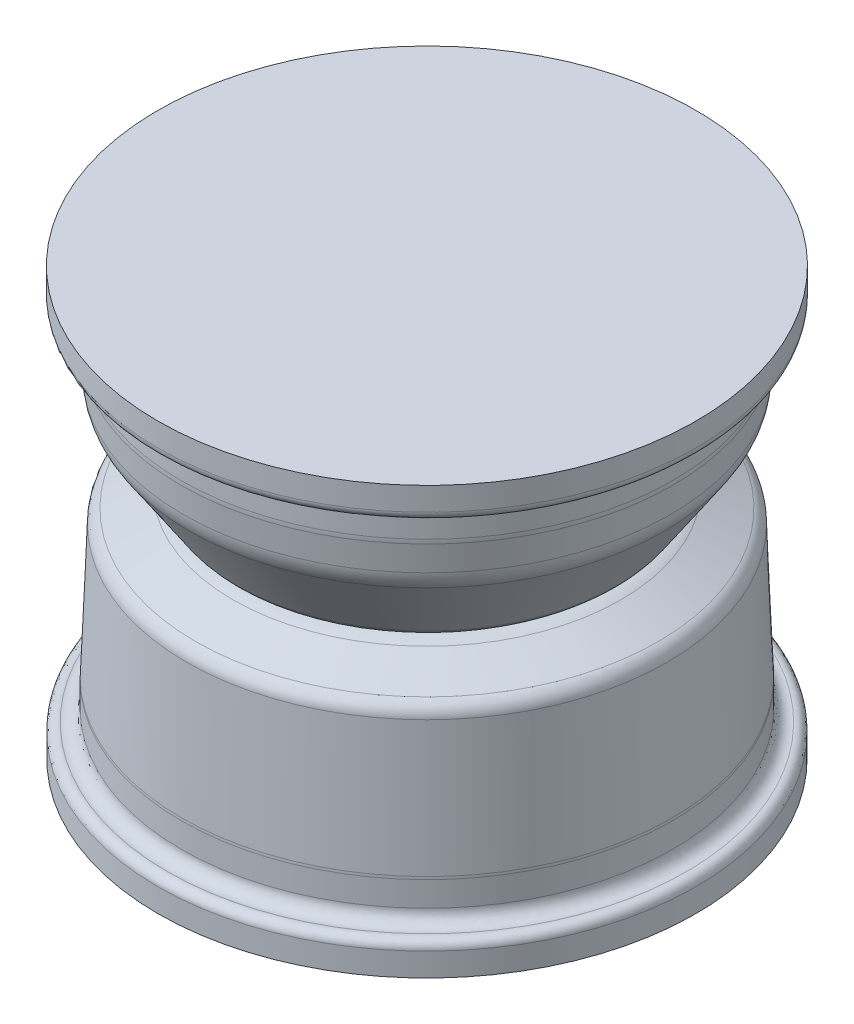
ISO-10303-21;
HEADER;
FILE_DESCRIPTION(('STEP AP214'),'2;1');
FILE_NAME('part.step','',(''),(''),'','','');
FILE_SCHEMA(('AUTOMOTIVE_DESIGN { 1 0 10303 214 1 1 1 1 }'));
ENDSEC;
DATA;
#1=APPLICATION_CONTEXT('core data for automotive mechanical design processes');
#2=APPLICATION_PROTOCOL_DEFINITION('international standard','automotive_design',2000,#1);
#3=PRODUCT_CONTEXT('',#1,'mechanical');
#4=PRODUCT('Part','Part','',(#3));
#5=PRODUCT_RELATED_PRODUCT_CATEGORY('part','',(#4));
#6=PRODUCT_DEFINITION_FORMATION('','',#4);
#7=PRODUCT_DEFINITION_CONTEXT('part definition',#1,'design');
#8=PRODUCT_DEFINITION('design','',#6,#7);
#9=PRODUCT_DEFINITION_SHAPE('','',#8);
#10=(LENGTH_UNIT() NAMED_UNIT(*) SI_UNIT(.MILLI.,.METRE.));
#11=(NAMED_UNIT(*) PLANE_ANGLE_UNIT() SI_UNIT($,.RADIAN.));
#12=(NAMED_UNIT(*) SI_UNIT($,.STERADIAN.) SOLID_ANGLE_UNIT());
#13=UNCERTAINTY_MEASURE_WITH_UNIT(LENGTH_MEASURE(1.E-05),#10,'distance_accuracy_value','');
#14=(GEOMETRIC_REPRESENTATION_CONTEXT(3) GLOBAL_UNCERTAINTY_ASSIGNED_CONTEXT((#13)) GLOBAL_UNIT_ASSIGNED_CONTEXT((#10,
#11,#12)) REPRESENTATION_CONTEXT('',''));
#15=CARTESIAN_POINT('',(0.,0.,0.));
#16=DIRECTION('',(0.,0.,1.));
#17=DIRECTION('',(1.,0.,0.));
#18=AXIS2_PLACEMENT_3D('',#15,#16,#17);
#19=CARTESIAN_POINT('',(0.,13.0472913738795,91.7987750000028));
#20=DIRECTION('',(0.,-1.,0.));
#21=DIRECTION('',(0.,0.,-1.));
#22=AXIS2_PLACEMENT_3D('',#19,#20,#21);
#23=PLANE('',#22);
#24=CARTESIAN_POINT('',(0.,13.0472913738795,0.));
#25=DIRECTION('',(0.,1.,0.));
#26=DIRECTION('',(0.,0.,1.));
#27=AXIS2_PLACEMENT_3D('',#24,#25,#26);
#28=CIRCLE('',#27,91.1860000000005);
#29=CARTESIAN_POINT('',(0.,13.0472913738795,91.1860000000005));
#30=VERTEX_POINT('',#29);
#31=EDGE_CURVE('E97',#30,#30,#28,.T.);
#32=ORIENTED_EDGE('',*,*,#31,.F.);
#33=EDGE_LOOP('',(#32));
#34=FACE_BOUND('',#33,.T.);
#35=CARTESIAN_POINT('',(0.,13.0472913738795,0.));
#36=DIRECTION('',(0.,1.,0.));
#37=DIRECTION('',(0.,0.,1.));
#38=AXIS2_PLACEMENT_3D('',#35,#36,#37);
#39=CIRCLE('',#38,91.7987750000028);
#40=CARTESIAN_POINT('',(0.,13.0472913738795,91.7987750000028));
#41=VERTEX_POINT('',#40);
#42=EDGE_CURVE('E10',#41,#41,#39,.T.);
#43=ORIENTED_EDGE('',*,*,#42,.T.);
#44=EDGE_LOOP('',(#43));
#45=FACE_BOUND('',#44,.T.);
#46=ADVANCED_FACE('F33',(#34,#45),#23,.F.);
#47=CARTESIAN_POINT('',(0.,13.0472913738795,91.7987750000028));
#48=CARTESIAN_POINT('',(0.,13.0472913738793,94.605850648923));
#49=CARTESIAN_POINT('',(0.,12.4331662406384,97.3224330848818));
#50=CARTESIAN_POINT('',(0.,11.2624547169263,99.8255002525088));
#51=(BOUNDED_CURVE() B_SPLINE_CURVE(3,(#47,#48,#49,#50),.UNSPECIFIED.,.F.,
.F.) B_SPLINE_CURVE_WITH_KNOTS((4,4),(0.,1.),
.UNSPECIFIED.) CURVE() GEOMETRIC_REPRESENTATION_ITEM() RATIONAL_B_SPLINE_CURVE((0.254333095030252,
0.254333095030252,0.258499793724843,0.266833191114025)) REPRESENTATION_ITEM(''));
#52=CARTESIAN_POINT('',(0.,55.,0.));
#53=DIRECTION('',(0.,1.,0.));
#54=AXIS1_PLACEMENT('',#52,#53);
#55=SURFACE_OF_REVOLUTION('',#51,#54);
#56=CARTESIAN_POINT('',(0.,11.2624547169263,0.));
#57=DIRECTION('',(0.,1.,0.));
#58=DIRECTION('',(0.,0.,1.));
#59=AXIS2_PLACEMENT_3D('',#56,#57,#58);
#60=CIRCLE('',#59,99.8255002525088);
#61=CARTESIAN_POINT('',(0.,11.2624547169263,99.8255002525088));
#62=VERTEX_POINT('',#61);
#63=EDGE_CURVE('E39',#62,#62,#60,.T.);
#64=ORIENTED_EDGE('',*,*,#63,.T.);
#65=EDGE_LOOP('',(#64));
#66=FACE_BOUND('',#65,.T.);
#67=ORIENTED_EDGE('',*,*,#42,.F.);
#68=EDGE_LOOP('',(#67));
#69=FACE_BOUND('',#68,.T.);
#70=ADVANCED_FACE('F111',(#66,#69),#55,.F.);
#71=CARTESIAN_POINT('',(0.,2.26769556187344,0.));
#72=DIRECTION('',(0.,-1.,0.));
#73=DIRECTION('',(0.,0.,-1.));
#74=AXIS2_PLACEMENT_3D('',#71,#72,#73);
#75=CONICAL_SURFACE('',#74,119.056955539065,1.13331210913777);
#76=ORIENTED_EDGE('',*,*,#63,.F.);
#77=EDGE_LOOP('',(#76));
#78=FACE_BOUND('',#77,.T.);
#79=CARTESIAN_POINT('',(0.,2.26769556187344,0.));
#80=DIRECTION('',(0.,1.,0.));
#81=DIRECTION('',(0.,0.,1.));
#82=AXIS2_PLACEMENT_3D('',#79,#80,#81);
#83=CIRCLE('',#82,119.056955539065);
#84=CARTESIAN_POINT('',(0.,2.26769556187344,119.056955539065));
#85=VERTEX_POINT('',#84);
#86=EDGE_CURVE('E43',#85,#85,#83,.T.);
#87=ORIENTED_EDGE('',*,*,#86,.T.);
#88=EDGE_LOOP('',(#87));
#89=FACE_BOUND('',#88,.T.);
#90=ADVANCED_FACE('F114',(#78,#89),#75,.T.);
#91=CARTESIAN_POINT('',(0.,-4.97886739746323,0.));
#92=DIRECTION('',(0.,1.,0.));
#93=DIRECTION('',(0.,0.,1.));
#94=AXIS2_PLACEMENT_3D('',#91,#92,#93);
#95=TOROIDAL_SURFACE('',#94,115.667659848753,8.);
#96=ORIENTED_EDGE('',*,*,#86,.F.);
#97=EDGE_LOOP('',(#96));
#98=FACE_BOUND('',#97,.T.);
#99=CARTESIAN_POINT('',(0.,-4.67176492476311,0.));
#100=DIRECTION('',(0.,1.,0.));
#101=DIRECTION('',(0.,0.,1.));
#102=AXIS2_PLACEMENT_3D('',#99,#100,#101);
#103=CIRCLE('',#102,123.661763180038);
#104=CARTESIAN_POINT('',(0.,-4.67176492476311,123.661763180038));
#105=VERTEX_POINT('',#104);
#106=EDGE_CURVE('E47',#105,#105,#103,.T.);
#107=ORIENTED_EDGE('',*,*,#106,.T.);
#108=EDGE_LOOP('',(#107));
#109=FACE_BOUND('',#108,.T.);
#110=ADVANCED_FACE('F117',(#98,#109),#95,.T.);
#111=CARTESIAN_POINT('',(0.,-72.7393119640824,0.));
#112=DIRECTION('',(0.,-1.,0.));
#113=DIRECTION('',(0.,0.,-1.));
#114=AXIS2_PLACEMENT_3D('',#111,#112,#113);
#115=CONICAL_SURFACE('',#114,126.276654574374,0.0383972435438753);
#116=ORIENTED_EDGE('',*,*,#106,.F.);
#117=EDGE_LOOP('',(#116));
#118=FACE_BOUND('',#117,.T.);
#119=CARTESIAN_POINT('',(0.,-72.7393119640824,0.));
#120=DIRECTION('',(0.,1.,0.));
#121=DIRECTION('',(0.,0.,1.));
#122=AXIS2_PLACEMENT_3D('',#119,#120,#121);
#123=CIRCLE('',#122,126.276654574374);
#124=CARTESIAN_POINT('',(0.,-72.7393119640824,126.276654574374));
#125=VERTEX_POINT('',#124);
#126=EDGE_CURVE('E52',#125,#125,#123,.T.);
#127=ORIENTED_EDGE('',*,*,#126,.T.);
#128=EDGE_LOOP('',(#127));
#129=FACE_BOUND('',#128,.T.);
#130=ADVANCED_FACE('F121',(#118,#129),#115,.T.);
#131=CARTESIAN_POINT('',(0.,-74.0828852821458,0.));
#132=DIRECTION('',(0.,1.,0.));
#133=DIRECTION('',(0.,0.,1.));
#134=AXIS2_PLACEMENT_3D('',#131,#132,#133);
#135=TOROIDAL_SURFACE('',#134,91.302452500002,35.);
#136=ORIENTED_EDGE('',*,*,#126,.F.);
#137=EDGE_LOOP('',(#136));
#138=FACE_BOUND('',#137,.T.);
#139=CARTESIAN_POINT('',(0.,-74.0828852821459,0.));
#140=DIRECTION('',(0.,1.,0.));
#141=DIRECTION('',(0.,0.,1.));
#142=AXIS2_PLACEMENT_3D('',#139,#140,#141);
#143=CIRCLE('',#142,126.302452500002);
#144=CARTESIAN_POINT('',(0.,-74.0828852821459,126.302452500002));
#145=VERTEX_POINT('',#144);
#146=EDGE_CURVE('E55',#145,#145,#143,.T.);
#147=ORIENTED_EDGE('',*,*,#146,.T.);
#148=EDGE_LOOP('',(#147));
#149=FACE_BOUND('',#148,.T.);
#150=ADVANCED_FACE('F125',(#138,#149),#135,.T.);
#151=CARTESIAN_POINT('',(0.,55.,0.));
#152=DIRECTION('',(0.,1.,0.));
#153=DIRECTION('',(0.,0.,1.));
#154=AXIS2_PLACEMENT_3D('',#151,#152,#153);
#155=CYLINDRICAL_SURFACE('',#154,126.302452500002);
#156=CARTESIAN_POINT('',(0.,-86.8372465785219,0.));
#157=DIRECTION('',(0.,1.,0.));
#158=DIRECTION('',(0.,0.,1.));
#159=AXIS2_PLACEMENT_3D('',#156,#157,#158);
#160=CIRCLE('',#159,126.302452500002);
#161=CARTESIAN_POINT('',(0.,-86.8372465785219,126.302452500002));
#162=VERTEX_POINT('',#161);
#163=EDGE_CURVE('E58',#162,#162,#160,.T.);
#164=ORIENTED_EDGE('',*,*,#163,.T.);
#165=EDGE_LOOP('',(#164));
#166=FACE_BOUND('',#165,.T.);
#167=ORIENTED_EDGE('',*,*,#146,.F.);
#168=EDGE_LOOP('',(#167));
#169=FACE_BOUND('',#168,.T.);
#170=ADVANCED_FACE('F129',(#166,#169),#155,.T.);
#171=CARTESIAN_POINT('',(0.,-93.1247086261212,133.519735500002));
#172=CARTESIAN_POINT('',(0.,-93.7891310907864,128.834697888006));
#173=CARTESIAN_POINT('',(0.,-90.3594848036121,126.302452500002));
#174=CARTESIAN_POINT('',(0.,-86.8372465785219,126.302452500002));
#175=(BOUNDED_CURVE() B_SPLINE_CURVE(3,(#171,#172,#173,#174),.UNSPECIFIED.,.F.,
.F.) B_SPLINE_CURVE_WITH_KNOTS((4,4),(0.,1.),
.UNSPECIFIED.) CURVE() GEOMETRIC_REPRESENTATION_ITEM() RATIONAL_B_SPLINE_CURVE((0.255591691964593,
0.242825015050018,0.327183181081988,0.508666190060503)) REPRESENTATION_ITEM(''));
#176=CARTESIAN_POINT('',(0.,55.,0.));
#177=DIRECTION('',(0.,1.,0.));
#178=AXIS1_PLACEMENT('',#176,#177);
#179=SURFACE_OF_REVOLUTION('',#175,#178);
#180=ORIENTED_EDGE('',*,*,#163,.F.);
#181=EDGE_LOOP('',(#180));
#182=FACE_BOUND('',#181,.T.);
#183=CARTESIAN_POINT('',(0.,-93.1247086261212,0.));
#184=DIRECTION('',(0.,1.,0.));
#185=DIRECTION('',(0.,0.,1.));
#186=AXIS2_PLACEMENT_3D('',#183,#184,#185);
#187=CIRCLE('',#186,133.519735500002);
#188=CARTESIAN_POINT('',(0.,-93.1247086261212,133.519735500002));
#189=VERTEX_POINT('',#188);
#190=EDGE_CURVE('E61',#189,#189,#187,.T.);
#191=ORIENTED_EDGE('',*,*,#190,.T.);
#192=EDGE_LOOP('',(#191));
#193=FACE_BOUND('',#192,.T.);
#194=ADVANCED_FACE('F133',(#182,#193),#179,.T.);
#195=CARTESIAN_POINT('',(0.,-93.1247086261212,133.519735500002));
#196=CARTESIAN_POINT('',(0.,-92.6729013501488,136.705561076159));
#197=CARTESIAN_POINT('',(0.,-95.0050608254273,138.427487940002));
#198=CARTESIAN_POINT('',(0.,-97.4001828184885,138.427487940002));
#199=(BOUNDED_CURVE() B_SPLINE_CURVE(3,(#195,#196,#197,#198),.UNSPECIFIED.,.F.,
.F.) B_SPLINE_CURVE_WITH_KNOTS((4,4),(0.,1.),
.UNSPECIFIED.) CURVE() GEOMETRIC_REPRESENTATION_ITEM() RATIONAL_B_SPLINE_CURVE((0.255591691964592,
0.242825015050017,0.327183181081988,0.508666190060503)) REPRESENTATION_ITEM(''));
#200=CARTESIAN_POINT('',(0.,55.,0.));
#201=DIRECTION('',(0.,1.,0.));
#202=AXIS1_PLACEMENT('',#200,#201);
#203=SURFACE_OF_REVOLUTION('',#199,#202);
#204=CARTESIAN_POINT('',(0.,-97.4001828184885,0.));
#205=DIRECTION('',(0.,1.,0.));
#206=DIRECTION('',(0.,0.,1.));
#207=AXIS2_PLACEMENT_3D('',#204,#205,#206);
#208=CIRCLE('',#207,138.427487940002);
#209=CARTESIAN_POINT('',(0.,-97.4001828184885,138.427487940002));
#210=VERTEX_POINT('',#209);
#211=EDGE_CURVE('E64',#210,#210,#208,.T.);
#212=ORIENTED_EDGE('',*,*,#211,.T.);
#213=EDGE_LOOP('',(#212));
#214=FACE_BOUND('',#213,.T.);
#215=ORIENTED_EDGE('',*,*,#190,.F.);
#216=EDGE_LOOP('',(#215));
#217=FACE_BOUND('',#216,.T.);
#218=ADVANCED_FACE('F137',(#214,#217),#203,.F.);
#219=CARTESIAN_POINT('',(0.,55.,0.));
#220=DIRECTION('',(0.,1.,0.));
#221=DIRECTION('',(0.,0.,1.));
#222=AXIS2_PLACEMENT_3D('',#219,#220,#221);
#223=CYLINDRICAL_SURFACE('',#222,138.427487940002);
#224=CARTESIAN_POINT('',(0.,-109.400182818489,0.));
#225=DIRECTION('',(0.,1.,0.));
#226=DIRECTION('',(0.,0.,1.));
#227=AXIS2_PLACEMENT_3D('',#224,#225,#226);
#228=CIRCLE('',#227,138.427487940002);
#229=CARTESIAN_POINT('',(0.,-109.400182818489,138.427487940002));
#230=VERTEX_POINT('',#229);
#231=EDGE_CURVE('E67',#230,#230,#228,.T.);
#232=ORIENTED_EDGE('',*,*,#231,.T.);
#233=EDGE_LOOP('',(#232));
#234=FACE_BOUND('',#233,.T.);
#235=ORIENTED_EDGE('',*,*,#211,.F.);
#236=EDGE_LOOP('',(#235));
#237=FACE_BOUND('',#236,.T.);
#238=ADVANCED_FACE('F141',(#234,#237),#223,.T.);
#239=CARTESIAN_POINT('',(0.,-109.400182818489,138.427487940002));
#240=DIRECTION('',(0.,-1.,0.));
#241=DIRECTION('',(0.,0.,-1.));
#242=AXIS2_PLACEMENT_3D('',#239,#240,#241);
#243=PLANE('',#242);
#244=ORIENTED_EDGE('',*,*,#231,.F.);
#245=EDGE_LOOP('',(#244));
#246=FACE_BOUND('',#245,.T.);
#247=ADVANCED_FACE('F151',(#246),#243,.T.);
#248=CARTESIAN_POINT('',(0.,110.365316058993,138.555289406168));
#249=DIRECTION('',(0.,-1.,0.));
#250=DIRECTION('',(0.,0.,-1.));
#251=AXIS2_PLACEMENT_3D('',#248,#249,#250);
#252=PLANE('',#251);
#253=CARTESIAN_POINT('',(0.,110.365316058993,0.));
#254=DIRECTION('',(0.,1.,0.));
#255=DIRECTION('',(0.,0.,1.));
#256=AXIS2_PLACEMENT_3D('',#253,#254,#255);
#257=CIRCLE('',#256,138.555289406168);
#258=CARTESIAN_POINT('',(0.,110.365316058993,138.555289406168));
#259=VERTEX_POINT('',#258);
#260=EDGE_CURVE('E70',#259,#259,#257,.T.);
#261=ORIENTED_EDGE('',*,*,#260,.T.);
#262=EDGE_LOOP('',(#261));
#263=FACE_BOUND('',#262,.T.);
#264=ADVANCED_FACE('F155',(#263),#252,.F.);
#265=CARTESIAN_POINT('',(0.,55.,0.));
#266=DIRECTION('',(0.,1.,0.));
#267=DIRECTION('',(0.,0.,1.));
#268=AXIS2_PLACEMENT_3D('',#265,#266,#267);
#269=CYLINDRICAL_SURFACE('',#268,138.555289406168);
#270=ORIENTED_EDGE('',*,*,#260,.F.);
#271=EDGE_LOOP('',(#270));
#272=FACE_BOUND('',#271,.T.);
#273=CARTESIAN_POINT('',(0.,98.3653160589928,0.));
#274=DIRECTION('',(0.,1.,0.));
#275=DIRECTION('',(0.,0.,1.));
#276=AXIS2_PLACEMENT_3D('',#273,#274,#275);
#277=CIRCLE('',#276,138.555289406168);
#278=CARTESIAN_POINT('',(0.,98.3653160589928,138.555289406168));
#279=VERTEX_POINT('',#278);
#280=EDGE_CURVE('E73',#279,#279,#277,.T.);
#281=ORIENTED_EDGE('',*,*,#280,.T.);
#282=EDGE_LOOP('',(#281));
#283=FACE_BOUND('',#282,.T.);
#284=ADVANCED_FACE('F159',(#272,#283),#269,.T.);
#285=CARTESIAN_POINT('',(0.,98.2420105318187,0.));
#286=DIRECTION('',(0.,1.,0.));
#287=DIRECTION('',(0.,0.,1.));
#288=AXIS2_PLACEMENT_3D('',#285,#286,#287);
#289=TOROIDAL_SURFACE('',#288,134.112,4.44499999999991);
#290=CARTESIAN_POINT('',(0.,93.8192913738797,0.));
#291=DIRECTION('',(0.,1.,0.));
#292=DIRECTION('',(0.,0.,1.));
#293=AXIS2_PLACEMENT_3D('',#290,#291,#292);
#294=CIRCLE('',#293,133.667500000001);
#295=CARTESIAN_POINT('',(0.,93.8192913738797,133.667500000001));
#296=VERTEX_POINT('',#295);
#297=EDGE_CURVE('E76',#296,#296,#294,.T.);
#298=ORIENTED_EDGE('',*,*,#297,.T.);
#299=EDGE_LOOP('',(#298));
#300=FACE_BOUND('',#299,.T.);
#301=ORIENTED_EDGE('',*,*,#280,.F.);
#302=EDGE_LOOP('',(#301));
#303=FACE_BOUND('',#302,.T.);
#304=ADVANCED_FACE('F163',(#300,#303),#289,.T.);
#305=CARTESIAN_POINT('',(0.,87.5011211482528,0.));
#306=DIRECTION('',(0.,1.,0.));
#307=DIRECTION('',(0.,0.,1.));
#308=AXIS2_PLACEMENT_3D('',#305,#306,#307);
#309=TOROIDAL_SURFACE('',#308,133.0325,6.34999999999996);
#310=ORIENTED_EDGE('',*,*,#297,.F.);
#311=EDGE_LOOP('',(#310));
#312=FACE_BOUND('',#311,.T.);
#313=CARTESIAN_POINT('',(0.,87.5011211482528,0.));
#314=DIRECTION('',(0.,1.,0.));
#315=DIRECTION('',(0.,0.,1.));
#316=AXIS2_PLACEMENT_3D('',#313,#314,#315);
#317=CIRCLE('',#316,126.6825);
#318=CARTESIAN_POINT('',(0.,87.5011211482528,126.6825));
#319=VERTEX_POINT('',#318);
#320=EDGE_CURVE('E79',#319,#319,#317,.T.);
#321=ORIENTED_EDGE('',*,*,#320,.T.);
#322=EDGE_LOOP('',(#321));
#323=FACE_BOUND('',#322,.T.);
#324=ADVANCED_FACE('F167',(#312,#323),#309,.F.);
#325=CARTESIAN_POINT('',(0.,55.,0.));
#326=DIRECTION('',(0.,1.,0.));
#327=DIRECTION('',(0.,0.,1.));
#328=AXIS2_PLACEMENT_3D('',#325,#326,#327);
#329=CYLINDRICAL_SURFACE('',#328,126.6825);
#330=CARTESIAN_POINT('',(0.,77.9442913738797,0.));
#331=DIRECTION('',(0.,1.,0.));
#332=DIRECTION('',(0.,0.,1.));
#333=AXIS2_PLACEMENT_3D('',#330,#331,#332);
#334=CIRCLE('',#333,126.6825);
#335=CARTESIAN_POINT('',(0.,77.9442913738797,126.6825));
#336=VERTEX_POINT('',#335);
#337=EDGE_CURVE('E82',#336,#336,#334,.T.);
#338=ORIENTED_EDGE('',*,*,#337,.T.);
#339=EDGE_LOOP('',(#338));
#340=FACE_BOUND('',#339,.T.);
#341=ORIENTED_EDGE('',*,*,#320,.F.);
#342=EDGE_LOOP('',(#341));
#343=FACE_BOUND('',#342,.T.);
#344=ADVANCED_FACE('F171',(#340,#343),#329,.T.);
#345=CARTESIAN_POINT('',(0.,77.9442913738795,0.));
#346=DIRECTION('',(0.,1.,0.));
#347=DIRECTION('',(0.,0.,1.));
#348=AXIS2_PLACEMENT_3D('',#345,#346,#347);
#349=TOROIDAL_SURFACE('',#348,101.2825,25.3999999999999);
#350=CARTESIAN_POINT('',(0.,75.7305355080894,0.));
#351=DIRECTION('',(0.,1.,0.));
#352=DIRECTION('',(0.,0.,1.));
#353=AXIS2_PLACEMENT_3D('',#350,#351,#352);
#354=CIRCLE('',#353,126.58584533153);
#355=CARTESIAN_POINT('',(0.,75.7305355080894,126.58584533153));
#356=VERTEX_POINT('',#355);
#357=EDGE_CURVE('E85',#356,#356,#354,.T.);
#358=ORIENTED_EDGE('',*,*,#357,.T.);
#359=EDGE_LOOP('',(#358));
#360=FACE_BOUND('',#359,.T.);
#361=ORIENTED_EDGE('',*,*,#337,.F.);
#362=EDGE_LOOP('',(#361));
#363=FACE_BOUND('',#362,.T.);
#364=ADVANCED_FACE('F175',(#360,#363),#349,.T.);
#365=CARTESIAN_POINT('',(0.,75.7305355080894,0.));
#366=DIRECTION('',(0.,1.,0.));
#367=DIRECTION('',(0.,0.,1.));
#368=AXIS2_PLACEMENT_3D('',#365,#366,#367);
#369=CONICAL_SURFACE('',#368,126.58584533153,0.0872664625997177);
#370=CARTESIAN_POINT('',(0.,62.0692913738798,0.));
#371=DIRECTION('',(0.,1.,0.));
#372=DIRECTION('',(0.,0.,1.));
#373=AXIS2_PLACEMENT_3D('',#370,#371,#372);
#374=CIRCLE('',#373,125.390641340127);
#375=CARTESIAN_POINT('',(0.,62.0692913738798,125.390641340127));
#376=VERTEX_POINT('',#375);
#377=EDGE_CURVE('E88',#376,#376,#374,.T.);
#378=ORIENTED_EDGE('',*,*,#377,.T.);
#379=EDGE_LOOP('',(#378));
#380=FACE_BOUND('',#379,.T.);
#381=ORIENTED_EDGE('',*,*,#357,.F.);
#382=EDGE_LOOP('',(#381));
#383=FACE_BOUND('',#382,.T.);
#384=ADVANCED_FACE('F179',(#380,#383),#369,.T.);
#385=CARTESIAN_POINT('',(0.,63.7296082732224,0.));
#386=DIRECTION('',(0.,1.,0.));
#387=DIRECTION('',(0.,0.,1.));
#388=AXIS2_PLACEMENT_3D('',#385,#386,#387);
#389=TOROIDAL_SURFACE('',#388,106.413132341479,19.05);
#390=CARTESIAN_POINT('',(0.,53.1367629291311,0.));
#391=DIRECTION('',(0.,1.,0.));
#392=DIRECTION('',(0.,0.,1.));
#393=AXIS2_PLACEMENT_3D('',#390,#391,#392);
#394=CIRCLE('',#393,122.246455666548);
#395=CARTESIAN_POINT('',(0.,53.1367629291311,122.246455666548));
#396=VERTEX_POINT('',#395);
#397=EDGE_CURVE('E91',#396,#396,#394,.T.);
#398=ORIENTED_EDGE('',*,*,#397,.T.);
#399=EDGE_LOOP('',(#398));
#400=FACE_BOUND('',#399,.T.);
#401=ORIENTED_EDGE('',*,*,#377,.F.);
#402=EDGE_LOOP('',(#401));
#403=FACE_BOUND('',#402,.T.);
#404=ADVANCED_FACE('F183',(#400,#403),#389,.T.);
#405=CARTESIAN_POINT('',(0.,53.1367629291311,0.));
#406=DIRECTION('',(0.,1.,0.));
#407=DIRECTION('',(0.,0.,1.));
#408=AXIS2_PLACEMENT_3D('',#405,#406,#407);
#409=CONICAL_SURFACE('',#408,122.246455666548,0.58963160852596);
#410=CARTESIAN_POINT('',(0.,16.5711058138414,0.));
#411=DIRECTION('',(0.,1.,0.));
#412=DIRECTION('',(0.,0.,1.));
#413=AXIS2_PLACEMENT_3D('',#410,#411,#412);
#414=CIRCLE('',#413,97.7832180521123);
#415=CARTESIAN_POINT('',(0.,16.5711058138414,97.7832180521123));
#416=VERTEX_POINT('',#415);
#417=EDGE_CURVE('E94',#416,#416,#414,.T.);
#418=ORIENTED_EDGE('',*,*,#417,.T.);
#419=EDGE_LOOP('',(#418));
#420=FACE_BOUND('',#419,.T.);
#421=ORIENTED_EDGE('',*,*,#397,.F.);
#422=EDGE_LOOP('',(#421));
#423=FACE_BOUND('',#422,.T.);
#424=ADVANCED_FACE('F187',(#420,#423),#409,.T.);
#425=CARTESIAN_POINT('',(0.,20.9847913738796,0.));
#426=DIRECTION('',(0.,1.,0.));
#427=DIRECTION('',(0.,0.,1.));
#428=AXIS2_PLACEMENT_3D('',#425,#426,#427);
#429=TOROIDAL_SURFACE('',#428,91.1860000000004,7.93750000000004);
#430=ORIENTED_EDGE('',*,*,#31,.T.);
#431=EDGE_LOOP('',(#430));
#432=FACE_BOUND('',#431,.T.);
#433=ORIENTED_EDGE('',*,*,#417,.F.);
#434=EDGE_LOOP('',(#433));
#435=FACE_BOUND('',#434,.T.);
#436=ADVANCED_FACE('F191',(#432,#435),#429,.T.);
#437=CLOSED_SHELL('',(#46,#70,#90,#110,#130,#150,#170,#194,#218,#238,#247,#264,#284,#304,#324,
#344,#364,#384,#404,#424,#436));
#438=MANIFOLD_SOLID_BREP('B2',#437);
#439=ADVANCED_BREP_SHAPE_REPRESENTATION('',(#18,#438),#14);
#440=SHAPE_DEFINITION_REPRESENTATION(#9,#439);
ENDSEC;
END-ISO-10303-21;
